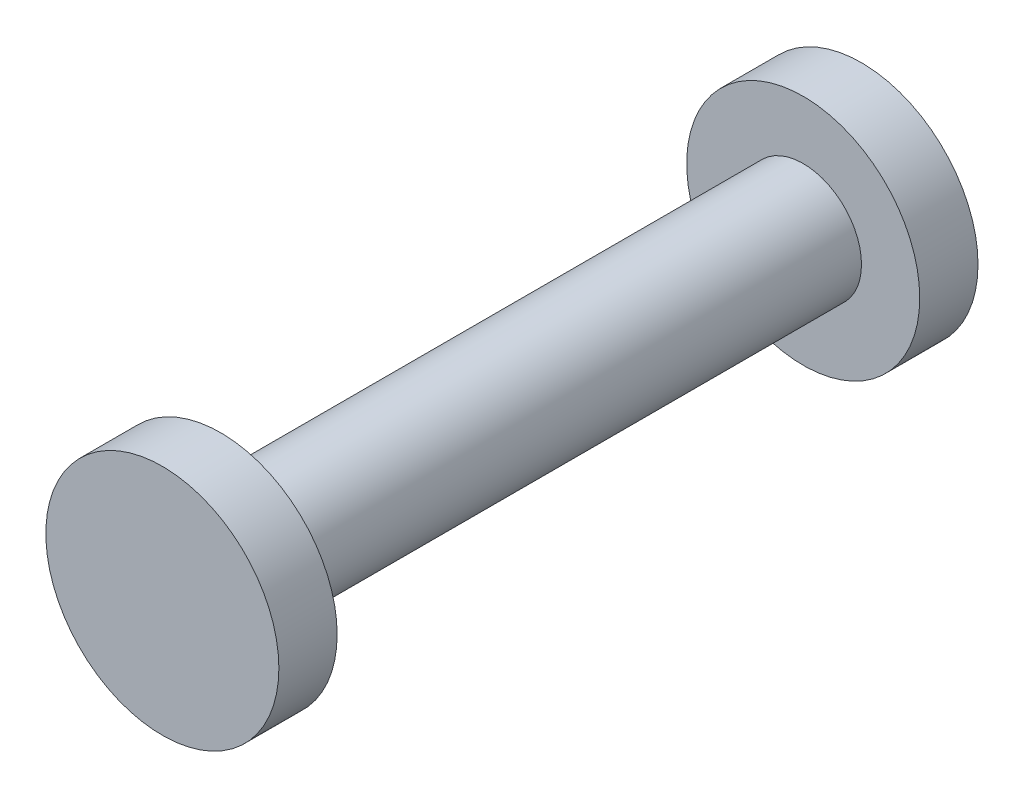
ISO-10303-21;
HEADER;
FILE_DESCRIPTION(('STEP AP214'),'2;1');
FILE_NAME('part.step','',(''),(''),'','','');
FILE_SCHEMA(('AUTOMOTIVE_DESIGN { 1 0 10303 214 1 1 1 1 }'));
ENDSEC;
DATA;
#1=APPLICATION_CONTEXT('core data for automotive mechanical design processes');
#2=APPLICATION_PROTOCOL_DEFINITION('international standard','automotive_design',2000,#1);
#3=PRODUCT_CONTEXT('',#1,'mechanical');
#4=PRODUCT('Part','Part','',(#3));
#5=PRODUCT_RELATED_PRODUCT_CATEGORY('part','',(#4));
#6=PRODUCT_DEFINITION_FORMATION('','',#4);
#7=PRODUCT_DEFINITION_CONTEXT('part definition',#1,'design');
#8=PRODUCT_DEFINITION('design','',#6,#7);
#9=PRODUCT_DEFINITION_SHAPE('','',#8);
#10=(LENGTH_UNIT() NAMED_UNIT(*) SI_UNIT(.MILLI.,.METRE.));
#11=(NAMED_UNIT(*) PLANE_ANGLE_UNIT() SI_UNIT($,.RADIAN.));
#12=(NAMED_UNIT(*) SI_UNIT($,.STERADIAN.) SOLID_ANGLE_UNIT());
#13=UNCERTAINTY_MEASURE_WITH_UNIT(LENGTH_MEASURE(1.E-05),#10,'distance_accuracy_value','');
#14=(GEOMETRIC_REPRESENTATION_CONTEXT(3) GLOBAL_UNCERTAINTY_ASSIGNED_CONTEXT((#13)) GLOBAL_UNIT_ASSIGNED_CONTEXT((#10,
#11,#12)) REPRESENTATION_CONTEXT('',''));
#15=CARTESIAN_POINT('',(0.,0.,0.));
#16=DIRECTION('',(0.,0.,1.));
#17=DIRECTION('',(1.,0.,0.));
#18=AXIS2_PLACEMENT_3D('',#15,#16,#17);
#19=CARTESIAN_POINT('',(0.,0.,25.));
#20=DIRECTION('',(0.,0.,-1.));
#21=DIRECTION('',(-1.,0.,0.));
#22=AXIS2_PLACEMENT_3D('',#19,#20,#21);
#23=CYLINDRICAL_SURFACE('',#22,5.);
#24=CARTESIAN_POINT('',(0.,0.,25.));
#25=DIRECTION('',(0.,0.,1.));
#26=DIRECTION('',(1.,0.,0.));
#27=AXIS2_PLACEMENT_3D('',#24,#25,#26);
#28=CIRCLE('',#27,5.);
#29=CARTESIAN_POINT('',(5.,0.,25.));
#30=VERTEX_POINT('',#29);
#31=EDGE_CURVE('E10',#30,#30,#28,.T.);
#32=ORIENTED_EDGE('',*,*,#31,.F.);
#33=EDGE_LOOP('',(#32));
#34=FACE_BOUND('',#33,.T.);
#35=CARTESIAN_POINT('',(0.,0.,-25.));
#36=DIRECTION('',(0.,0.,1.));
#37=DIRECTION('',(1.,0.,0.));
#38=AXIS2_PLACEMENT_3D('',#35,#36,#37);
#39=CIRCLE('',#38,5.);
#40=CARTESIAN_POINT('',(5.,0.,-25.));
#41=VERTEX_POINT('',#40);
#42=EDGE_CURVE('E40',#41,#41,#39,.T.);
#43=ORIENTED_EDGE('',*,*,#42,.T.);
#44=EDGE_LOOP('',(#43));
#45=FACE_BOUND('',#44,.T.);
#46=ADVANCED_FACE('F37',(#34,#45),#23,.T.);
#47=CARTESIAN_POINT('',(0.,0.,30.));
#48=DIRECTION('',(0.,0.,-1.));
#49=DIRECTION('',(-1.,0.,0.));
#50=AXIS2_PLACEMENT_3D('',#47,#48,#49);
#51=CYLINDRICAL_SURFACE('',#50,10.);
#52=CARTESIAN_POINT('',(0.,0.,30.));
#53=DIRECTION('',(0.,0.,1.));
#54=DIRECTION('',(1.,0.,0.));
#55=AXIS2_PLACEMENT_3D('',#52,#53,#54);
#56=CIRCLE('',#55,10.);
#57=CARTESIAN_POINT('',(10.,0.,30.));
#58=VERTEX_POINT('',#57);
#59=EDGE_CURVE('E45',#58,#58,#56,.T.);
#60=ORIENTED_EDGE('',*,*,#59,.F.);
#61=EDGE_LOOP('',(#60));
#62=FACE_BOUND('',#61,.T.);
#63=CARTESIAN_POINT('',(0.,0.,25.));
#64=DIRECTION('',(0.,0.,1.));
#65=DIRECTION('',(1.,0.,0.));
#66=AXIS2_PLACEMENT_3D('',#63,#64,#65);
#67=CIRCLE('',#66,10.);
#68=CARTESIAN_POINT('',(10.,0.,25.));
#69=VERTEX_POINT('',#68);
#70=EDGE_CURVE('E50',#69,#69,#67,.T.);
#71=ORIENTED_EDGE('',*,*,#70,.T.);
#72=EDGE_LOOP('',(#71));
#73=FACE_BOUND('',#72,.T.);
#74=ADVANCED_FACE('F91',(#62,#73),#51,.T.);
#75=CARTESIAN_POINT('',(0.,0.,30.));
#76=DIRECTION('',(0.,0.,1.));
#77=DIRECTION('',(1.,0.,0.));
#78=AXIS2_PLACEMENT_3D('',#75,#76,#77);
#79=PLANE('',#78);
#80=ORIENTED_EDGE('',*,*,#59,.T.);
#81=EDGE_LOOP('',(#80));
#82=FACE_BOUND('',#81,.T.);
#83=ADVANCED_FACE('F87',(#82),#79,.T.);
#84=CARTESIAN_POINT('',(0.,0.,25.));
#85=DIRECTION('',(0.,0.,1.));
#86=DIRECTION('',(1.,0.,0.));
#87=AXIS2_PLACEMENT_3D('',#84,#85,#86);
#88=PLANE('',#87);
#89=ORIENTED_EDGE('',*,*,#31,.T.);
#90=EDGE_LOOP('',(#89));
#91=FACE_BOUND('',#90,.T.);
#92=ORIENTED_EDGE('',*,*,#70,.F.);
#93=EDGE_LOOP('',(#92));
#94=FACE_BOUND('',#93,.T.);
#95=ADVANCED_FACE('F79',(#91,#94),#88,.F.);
#96=CARTESIAN_POINT('',(0.,0.,-30.));
#97=DIRECTION('',(0.,0.,1.));
#98=DIRECTION('',(1.,0.,0.));
#99=AXIS2_PLACEMENT_3D('',#96,#97,#98);
#100=CYLINDRICAL_SURFACE('',#99,10.);
#101=CARTESIAN_POINT('',(0.,0.,-30.));
#102=DIRECTION('',(0.,0.,1.));
#103=DIRECTION('',(1.,0.,0.));
#104=AXIS2_PLACEMENT_3D('',#101,#102,#103);
#105=CIRCLE('',#104,10.);
#106=CARTESIAN_POINT('',(10.,0.,-30.));
#107=VERTEX_POINT('',#106);
#108=EDGE_CURVE('E60',#107,#107,#105,.T.);
#109=ORIENTED_EDGE('',*,*,#108,.T.);
#110=EDGE_LOOP('',(#109));
#111=FACE_BOUND('',#110,.T.);
#112=CARTESIAN_POINT('',(0.,0.,-25.));
#113=DIRECTION('',(0.,0.,1.));
#114=DIRECTION('',(1.,0.,0.));
#115=AXIS2_PLACEMENT_3D('',#112,#113,#114);
#116=CIRCLE('',#115,10.);
#117=CARTESIAN_POINT('',(10.,0.,-25.));
#118=VERTEX_POINT('',#117);
#119=EDGE_CURVE('E56',#118,#118,#116,.T.);
#120=ORIENTED_EDGE('',*,*,#119,.F.);
#121=EDGE_LOOP('',(#120));
#122=FACE_BOUND('',#121,.T.);
#123=ADVANCED_FACE('F77',(#111,#122),#100,.T.);
#124=CARTESIAN_POINT('',(0.,0.,-30.));
#125=DIRECTION('',(0.,0.,-1.));
#126=DIRECTION('',(1.,0.,0.));
#127=AXIS2_PLACEMENT_3D('',#124,#125,#126);
#128=PLANE('',#127);
#129=ORIENTED_EDGE('',*,*,#108,.F.);
#130=EDGE_LOOP('',(#129));
#131=FACE_BOUND('',#130,.T.);
#132=ADVANCED_FACE('F73',(#131),#128,.T.);
#133=CARTESIAN_POINT('',(0.,0.,-25.));
#134=DIRECTION('',(0.,0.,-1.));
#135=DIRECTION('',(1.,0.,0.));
#136=AXIS2_PLACEMENT_3D('',#133,#134,#135);
#137=PLANE('',#136);
#138=ORIENTED_EDGE('',*,*,#42,.F.);
#139=EDGE_LOOP('',(#138));
#140=FACE_BOUND('',#139,.T.);
#141=ORIENTED_EDGE('',*,*,#119,.T.);
#142=EDGE_LOOP('',(#141));
#143=FACE_BOUND('',#142,.T.);
#144=ADVANCED_FACE('F70',(#140,#143),#137,.F.);
#145=CLOSED_SHELL('',(#46,#74,#83,#95,#123,#132,#144));
#146=MANIFOLD_SOLID_BREP('B2',#145);
#147=ADVANCED_BREP_SHAPE_REPRESENTATION('',(#18,#146),#14);
#148=SHAPE_DEFINITION_REPRESENTATION(#9,#147);
ENDSEC;
END-ISO-10303-21;
